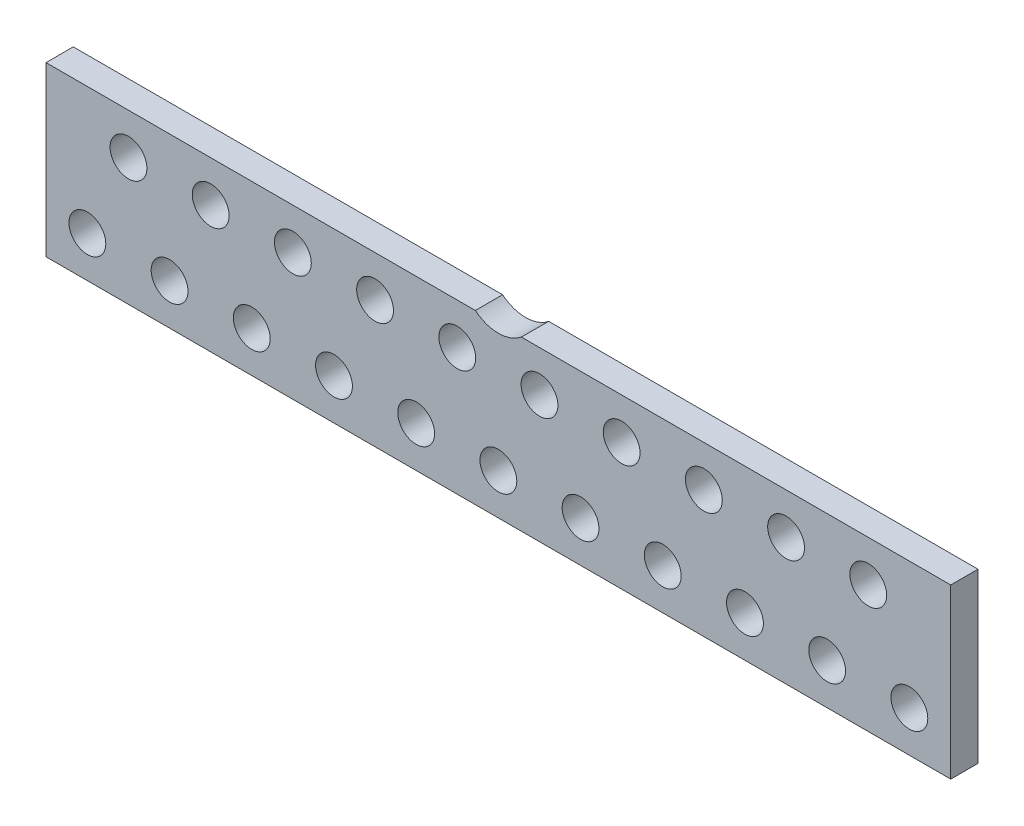
ISO-10303-21;
HEADER;
FILE_DESCRIPTION(('STEP AP214'),'2;1');
FILE_NAME('part.step','',(''),(''),'','','');
FILE_SCHEMA(('AUTOMOTIVE_DESIGN { 1 0 10303 214 1 1 1 1 }'));
ENDSEC;
DATA;
#1=APPLICATION_CONTEXT('core data for automotive mechanical design processes');
#2=APPLICATION_PROTOCOL_DEFINITION('international standard','automotive_design',2000,#1);
#3=PRODUCT_CONTEXT('',#1,'mechanical');
#4=PRODUCT('Part','Part','',(#3));
#5=PRODUCT_RELATED_PRODUCT_CATEGORY('part','',(#4));
#6=PRODUCT_DEFINITION_FORMATION('','',#4);
#7=PRODUCT_DEFINITION_CONTEXT('part definition',#1,'design');
#8=PRODUCT_DEFINITION('design','',#6,#7);
#9=PRODUCT_DEFINITION_SHAPE('','',#8);
#10=(LENGTH_UNIT() NAMED_UNIT(*) SI_UNIT(.MILLI.,.METRE.));
#11=(NAMED_UNIT(*) PLANE_ANGLE_UNIT() SI_UNIT($,.RADIAN.));
#12=(NAMED_UNIT(*) SI_UNIT($,.STERADIAN.) SOLID_ANGLE_UNIT());
#13=UNCERTAINTY_MEASURE_WITH_UNIT(LENGTH_MEASURE(1.E-05),#10,'distance_accuracy_value','');
#14=(GEOMETRIC_REPRESENTATION_CONTEXT(3) GLOBAL_UNCERTAINTY_ASSIGNED_CONTEXT((#13)) GLOBAL_UNIT_ASSIGNED_CONTEXT((#10,
#11,#12)) REPRESENTATION_CONTEXT('',''));
#15=CARTESIAN_POINT('',(0.,0.,0.));
#16=DIRECTION('',(0.,0.,1.));
#17=DIRECTION('',(1.,0.,0.));
#18=AXIS2_PLACEMENT_3D('',#15,#16,#17);
#19=CARTESIAN_POINT('',(0.,4.915,1.066));
#20=DIRECTION('',(0.,0.,1.));
#21=DIRECTION('',(1.,0.,0.));
#22=AXIS2_PLACEMENT_3D('',#19,#20,#21);
#23=CYLINDRICAL_SURFACE('',#22,1.59207048288274);
#24=CARTESIAN_POINT('',(0.,4.915,2.26));
#25=DIRECTION('',(0.,0.,1.));
#26=DIRECTION('',(1.,0.,0.));
#27=AXIS2_PLACEMENT_3D('',#24,#25,#26);
#28=CIRCLE('',#27,1.59207048288274);
#29=CARTESIAN_POINT('',(-1.00839695679156,3.683,2.26));
#30=VERTEX_POINT('',#29);
#31=CARTESIAN_POINT('',(1.00839695679156,3.683,2.26));
#32=VERTEX_POINT('',#31);
#33=EDGE_CURVE('E117',#30,#32,#28,.T.);
#34=ORIENTED_EDGE('',*,*,#33,.T.);
#35=DIRECTION('',(0.,0.,1.));
#36=VECTOR('',#35,1.);
#37=CARTESIAN_POINT('',(1.00839695679156,3.683,1.066));
#38=LINE('',#37,#36);
#39=CARTESIAN_POINT('',(1.00839695679156,3.683,1.066));
#40=VERTEX_POINT('',#39);
#41=EDGE_CURVE('E11',#40,#32,#38,.T.);
#42=ORIENTED_EDGE('',*,*,#41,.F.);
#43=CARTESIAN_POINT('',(0.,4.915,1.066));
#44=DIRECTION('',(0.,0.,1.));
#45=DIRECTION('',(1.,0.,0.));
#46=AXIS2_PLACEMENT_3D('',#43,#44,#45);
#47=CIRCLE('',#46,1.59207048288274);
#48=CARTESIAN_POINT('',(-1.00839695679156,3.683,1.066));
#49=VERTEX_POINT('',#48);
#50=EDGE_CURVE('E131',#49,#40,#47,.T.);
#51=ORIENTED_EDGE('',*,*,#50,.F.);
#52=DIRECTION('',(0.,0.,1.));
#53=VECTOR('',#52,1.);
#54=CARTESIAN_POINT('',(-1.00839695679156,3.683,1.066));
#55=LINE('',#54,#53);
#56=EDGE_CURVE('E49',#49,#30,#55,.T.);
#57=ORIENTED_EDGE('',*,*,#56,.T.);
#58=EDGE_LOOP('',(#34,#42,#51,#57));
#59=FACE_BOUND('',#58,.T.);
#60=ADVANCED_FACE('F33',(#59),#23,.F.);
#61=CARTESIAN_POINT('',(1.00839695679156,3.683,1.066));
#62=DIRECTION('',(0.,-1.,0.));
#63=DIRECTION('',(0.,0.,-1.));
#64=AXIS2_PLACEMENT_3D('',#61,#62,#63);
#65=PLANE('',#64);
#66=DIRECTION('',(1.,0.,0.));
#67=VECTOR('',#66,1.);
#68=CARTESIAN_POINT('',(1.00839695679156,3.683,2.26));
#69=LINE('',#68,#67);
#70=CARTESIAN_POINT('',(19.812,3.683,2.26));
#71=VERTEX_POINT('',#70);
#72=EDGE_CURVE('E119',#32,#71,#69,.T.);
#73=ORIENTED_EDGE('',*,*,#72,.T.);
#74=DIRECTION('',(0.,0.,1.));
#75=VECTOR('',#74,1.);
#76=CARTESIAN_POINT('',(19.812,3.683,1.066));
#77=LINE('',#76,#75);
#78=CARTESIAN_POINT('',(19.812,3.683,1.066));
#79=VERTEX_POINT('',#78);
#80=EDGE_CURVE('E41',#79,#71,#77,.T.);
#81=ORIENTED_EDGE('',*,*,#80,.F.);
#82=DIRECTION('',(1.,0.,0.));
#83=VECTOR('',#82,1.);
#84=CARTESIAN_POINT('',(1.00839695679156,3.683,1.066));
#85=LINE('',#84,#83);
#86=EDGE_CURVE('E81',#40,#79,#85,.T.);
#87=ORIENTED_EDGE('',*,*,#86,.F.);
#88=ORIENTED_EDGE('',*,*,#41,.T.);
#89=EDGE_LOOP('',(#73,#81,#87,#88));
#90=FACE_BOUND('',#89,.T.);
#91=ADVANCED_FACE('F152',(#90),#65,.F.);
#92=CARTESIAN_POINT('',(19.812,3.683,1.066));
#93=DIRECTION('',(-1.,0.,0.));
#94=DIRECTION('',(0.,0.,1.));
#95=AXIS2_PLACEMENT_3D('',#92,#93,#94);
#96=PLANE('',#95);
#97=DIRECTION('',(0.,-1.,0.));
#98=VECTOR('',#97,1.);
#99=CARTESIAN_POINT('',(19.812,3.683,2.26));
#100=LINE('',#99,#98);
#101=CARTESIAN_POINT('',(19.812,-3.683,2.26));
#102=VERTEX_POINT('',#101);
#103=EDGE_CURVE('E122',#71,#102,#100,.T.);
#104=ORIENTED_EDGE('',*,*,#103,.T.);
#105=DIRECTION('',(0.,0.,1.));
#106=VECTOR('',#105,1.);
#107=CARTESIAN_POINT('',(19.812,-3.683,1.066));
#108=LINE('',#107,#106);
#109=CARTESIAN_POINT('',(19.812,-3.683,1.066));
#110=VERTEX_POINT('',#109);
#111=EDGE_CURVE('E100',#110,#102,#108,.T.);
#112=ORIENTED_EDGE('',*,*,#111,.F.);
#113=DIRECTION('',(0.,-1.,0.));
#114=VECTOR('',#113,1.);
#115=CARTESIAN_POINT('',(19.812,3.683,1.066));
#116=LINE('',#115,#114);
#117=EDGE_CURVE('E108',#79,#110,#116,.T.);
#118=ORIENTED_EDGE('',*,*,#117,.F.);
#119=ORIENTED_EDGE('',*,*,#80,.T.);
#120=EDGE_LOOP('',(#104,#112,#118,#119));
#121=FACE_BOUND('',#120,.T.);
#122=ADVANCED_FACE('F137',(#121),#96,.F.);
#123=CARTESIAN_POINT('',(-19.8120000000001,-3.683,1.066));
#124=DIRECTION('',(0.,-1.,0.));
#125=DIRECTION('',(0.,0.,-1.));
#126=AXIS2_PLACEMENT_3D('',#123,#124,#125);
#127=PLANE('',#126);
#128=DIRECTION('',(1.,0.,0.));
#129=VECTOR('',#128,1.);
#130=CARTESIAN_POINT('',(-19.8120000000001,-3.683,2.26));
#131=LINE('',#130,#129);
#132=CARTESIAN_POINT('',(-19.8120000000001,-3.683,2.26));
#133=VERTEX_POINT('',#132);
#134=EDGE_CURVE('E96',#133,#102,#131,.T.);
#135=ORIENTED_EDGE('',*,*,#134,.F.);
#136=DIRECTION('',(0.,0.,1.));
#137=VECTOR('',#136,1.);
#138=CARTESIAN_POINT('',(-19.8120000000001,-3.683,1.066));
#139=LINE('',#138,#137);
#140=CARTESIAN_POINT('',(-19.8120000000001,-3.683,1.066));
#141=VERTEX_POINT('',#140);
#142=EDGE_CURVE('E91',#141,#133,#139,.T.);
#143=ORIENTED_EDGE('',*,*,#142,.F.);
#144=DIRECTION('',(1.,0.,0.));
#145=VECTOR('',#144,1.);
#146=CARTESIAN_POINT('',(-19.8120000000001,-3.683,1.066));
#147=LINE('',#146,#145);
#148=EDGE_CURVE('E94',#141,#110,#147,.T.);
#149=ORIENTED_EDGE('',*,*,#148,.T.);
#150=ORIENTED_EDGE('',*,*,#111,.T.);
#151=EDGE_LOOP('',(#135,#143,#149,#150));
#152=FACE_BOUND('',#151,.T.);
#153=ADVANCED_FACE('F93',(#152),#127,.T.);
#154=CARTESIAN_POINT('',(-19.8120000000001,3.683,1.066));
#155=DIRECTION('',(-1.,0.,0.));
#156=DIRECTION('',(0.,0.,1.));
#157=AXIS2_PLACEMENT_3D('',#154,#155,#156);
#158=PLANE('',#157);
#159=DIRECTION('',(0.,-1.,0.));
#160=VECTOR('',#159,1.);
#161=CARTESIAN_POINT('',(-19.8120000000001,3.683,2.26));
#162=LINE('',#161,#160);
#163=CARTESIAN_POINT('',(-19.8120000000001,3.683,2.26));
#164=VERTEX_POINT('',#163);
#165=EDGE_CURVE('E126',#164,#133,#162,.T.);
#166=ORIENTED_EDGE('',*,*,#165,.F.);
#167=DIRECTION('',(0.,0.,1.));
#168=VECTOR('',#167,1.);
#169=CARTESIAN_POINT('',(-19.8120000000001,3.683,1.066));
#170=LINE('',#169,#168);
#171=CARTESIAN_POINT('',(-19.8120000000001,3.683,1.066));
#172=VERTEX_POINT('',#171);
#173=EDGE_CURVE('E69',#172,#164,#170,.T.);
#174=ORIENTED_EDGE('',*,*,#173,.F.);
#175=DIRECTION('',(0.,-1.,0.));
#176=VECTOR('',#175,1.);
#177=CARTESIAN_POINT('',(-19.8120000000001,3.683,1.066));
#178=LINE('',#177,#176);
#179=EDGE_CURVE('E106',#172,#141,#178,.T.);
#180=ORIENTED_EDGE('',*,*,#179,.T.);
#181=ORIENTED_EDGE('',*,*,#142,.T.);
#182=EDGE_LOOP('',(#166,#174,#180,#181));
#183=FACE_BOUND('',#182,.T.);
#184=ADVANCED_FACE('F111',(#183),#158,.T.);
#185=CARTESIAN_POINT('',(-1.00839695679156,3.683,1.066));
#186=DIRECTION('',(0.,1.,0.));
#187=DIRECTION('',(0.,0.,1.));
#188=AXIS2_PLACEMENT_3D('',#185,#186,#187);
#189=PLANE('',#188);
#190=DIRECTION('',(-1.,0.,0.));
#191=VECTOR('',#190,1.);
#192=CARTESIAN_POINT('',(-1.00839695679156,3.683,2.26));
#193=LINE('',#192,#191);
#194=EDGE_CURVE('E128',#30,#164,#193,.T.);
#195=ORIENTED_EDGE('',*,*,#194,.F.);
#196=ORIENTED_EDGE('',*,*,#56,.F.);
#197=DIRECTION('',(-1.,0.,0.));
#198=VECTOR('',#197,1.);
#199=CARTESIAN_POINT('',(-1.00839695679156,3.683,1.066));
#200=LINE('',#199,#198);
#201=EDGE_CURVE('E112',#49,#172,#200,.T.);
#202=ORIENTED_EDGE('',*,*,#201,.T.);
#203=ORIENTED_EDGE('',*,*,#173,.T.);
#204=EDGE_LOOP('',(#195,#196,#202,#203));
#205=FACE_BOUND('',#204,.T.);
#206=ADVANCED_FACE('F140',(#205),#189,.T.);
#207=CARTESIAN_POINT('',(0.,4.915,1.066));
#208=DIRECTION('',(0.,0.,1.));
#209=DIRECTION('',(1.,0.,0.));
#210=AXIS2_PLACEMENT_3D('',#207,#208,#209);
#211=PLANE('',#210);
#212=CARTESIAN_POINT('',(16.2,1.885,1.066));
#213=DIRECTION('',(0.,0.,1.));
#214=DIRECTION('',(1.,0.,0.));
#215=AXIS2_PLACEMENT_3D('',#212,#213,#214);
#216=CIRCLE('',#215,0.8065);
#217=CARTESIAN_POINT('',(17.0065,1.885,1.066));
#218=VERTEX_POINT('',#217);
#219=EDGE_CURVE('E277',#218,#218,#216,.T.);
#220=ORIENTED_EDGE('',*,*,#219,.T.);
#221=EDGE_LOOP('',(#220));
#222=FACE_BOUND('',#221,.T.);
#223=CARTESIAN_POINT('',(12.6,1.885,1.066));
#224=DIRECTION('',(0.,0.,1.));
#225=DIRECTION('',(1.,0.,0.));
#226=AXIS2_PLACEMENT_3D('',#223,#224,#225);
#227=CIRCLE('',#226,0.8065);
#228=CARTESIAN_POINT('',(13.4065,1.885,1.066));
#229=VERTEX_POINT('',#228);
#230=EDGE_CURVE('E271',#229,#229,#227,.T.);
#231=ORIENTED_EDGE('',*,*,#230,.T.);
#232=EDGE_LOOP('',(#231));
#233=FACE_BOUND('',#232,.T.);
#234=CARTESIAN_POINT('',(8.99999999999999,1.885,1.066));
#235=DIRECTION('',(0.,0.,1.));
#236=DIRECTION('',(1.,0.,0.));
#237=AXIS2_PLACEMENT_3D('',#234,#235,#236);
#238=CIRCLE('',#237,0.8065);
#239=CARTESIAN_POINT('',(9.80649999999999,1.885,1.066));
#240=VERTEX_POINT('',#239);
#241=EDGE_CURVE('E265',#240,#240,#238,.T.);
#242=ORIENTED_EDGE('',*,*,#241,.T.);
#243=EDGE_LOOP('',(#242));
#244=FACE_BOUND('',#243,.T.);
#245=CARTESIAN_POINT('',(5.4,1.885,1.066));
#246=DIRECTION('',(0.,0.,1.));
#247=DIRECTION('',(1.,0.,0.));
#248=AXIS2_PLACEMENT_3D('',#245,#246,#247);
#249=CIRCLE('',#248,0.8065);
#250=CARTESIAN_POINT('',(6.20649999999999,1.885,1.066));
#251=VERTEX_POINT('',#250);
#252=EDGE_CURVE('E259',#251,#251,#249,.T.);
#253=ORIENTED_EDGE('',*,*,#252,.T.);
#254=EDGE_LOOP('',(#253));
#255=FACE_BOUND('',#254,.T.);
#256=CARTESIAN_POINT('',(1.8,1.885,1.066));
#257=DIRECTION('',(0.,0.,1.));
#258=DIRECTION('',(1.,0.,0.));
#259=AXIS2_PLACEMENT_3D('',#256,#257,#258);
#260=CIRCLE('',#259,0.8065);
#261=CARTESIAN_POINT('',(2.6065,1.885,1.066));
#262=VERTEX_POINT('',#261);
#263=EDGE_CURVE('E253',#262,#262,#260,.T.);
#264=ORIENTED_EDGE('',*,*,#263,.T.);
#265=EDGE_LOOP('',(#264));
#266=FACE_BOUND('',#265,.T.);
#267=CARTESIAN_POINT('',(-1.8,1.885,1.066));
#268=DIRECTION('',(0.,0.,1.));
#269=DIRECTION('',(1.,0.,0.));
#270=AXIS2_PLACEMENT_3D('',#267,#268,#269);
#271=CIRCLE('',#270,0.8065);
#272=CARTESIAN_POINT('',(-0.993500000000003,1.885,1.066));
#273=VERTEX_POINT('',#272);
#274=EDGE_CURVE('E247',#273,#273,#271,.T.);
#275=ORIENTED_EDGE('',*,*,#274,.T.);
#276=EDGE_LOOP('',(#275));
#277=FACE_BOUND('',#276,.T.);
#278=CARTESIAN_POINT('',(-5.4,1.885,1.066));
#279=DIRECTION('',(0.,0.,1.));
#280=DIRECTION('',(1.,0.,0.));
#281=AXIS2_PLACEMENT_3D('',#278,#279,#280);
#282=CIRCLE('',#281,0.8065);
#283=CARTESIAN_POINT('',(-4.5935,1.885,1.066));
#284=VERTEX_POINT('',#283);
#285=EDGE_CURVE('E241',#284,#284,#282,.T.);
#286=ORIENTED_EDGE('',*,*,#285,.T.);
#287=EDGE_LOOP('',(#286));
#288=FACE_BOUND('',#287,.T.);
#289=CARTESIAN_POINT('',(-9.,1.885,1.066));
#290=DIRECTION('',(0.,0.,1.));
#291=DIRECTION('',(1.,0.,0.));
#292=AXIS2_PLACEMENT_3D('',#289,#290,#291);
#293=CIRCLE('',#292,0.8065);
#294=CARTESIAN_POINT('',(-8.1935,1.885,1.066));
#295=VERTEX_POINT('',#294);
#296=EDGE_CURVE('E235',#295,#295,#293,.T.);
#297=ORIENTED_EDGE('',*,*,#296,.T.);
#298=EDGE_LOOP('',(#297));
#299=FACE_BOUND('',#298,.T.);
#300=CARTESIAN_POINT('',(-12.6,1.885,1.066));
#301=DIRECTION('',(0.,0.,1.));
#302=DIRECTION('',(1.,0.,0.));
#303=AXIS2_PLACEMENT_3D('',#300,#301,#302);
#304=CIRCLE('',#303,0.8065);
#305=CARTESIAN_POINT('',(-11.7935,1.885,1.066));
#306=VERTEX_POINT('',#305);
#307=EDGE_CURVE('E229',#306,#306,#304,.T.);
#308=ORIENTED_EDGE('',*,*,#307,.T.);
#309=EDGE_LOOP('',(#308));
#310=FACE_BOUND('',#309,.T.);
#311=CARTESIAN_POINT('',(18.,-1.885,1.066));
#312=DIRECTION('',(0.,0.,1.));
#313=DIRECTION('',(1.,0.,0.));
#314=AXIS2_PLACEMENT_3D('',#311,#312,#313);
#315=CIRCLE('',#314,0.806500000000003);
#316=CARTESIAN_POINT('',(18.8065,-1.885,1.066));
#317=VERTEX_POINT('',#316);
#318=EDGE_CURVE('E223',#317,#317,#315,.T.);
#319=ORIENTED_EDGE('',*,*,#318,.T.);
#320=EDGE_LOOP('',(#319));
#321=FACE_BOUND('',#320,.T.);
#322=CARTESIAN_POINT('',(14.4,-1.885,1.066));
#323=DIRECTION('',(0.,0.,1.));
#324=DIRECTION('',(1.,0.,0.));
#325=AXIS2_PLACEMENT_3D('',#322,#323,#324);
#326=CIRCLE('',#325,0.806500000000003);
#327=CARTESIAN_POINT('',(15.2065,-1.885,1.066));
#328=VERTEX_POINT('',#327);
#329=EDGE_CURVE('E217',#328,#328,#326,.T.);
#330=ORIENTED_EDGE('',*,*,#329,.T.);
#331=EDGE_LOOP('',(#330));
#332=FACE_BOUND('',#331,.T.);
#333=CARTESIAN_POINT('',(10.8,-1.885,1.066));
#334=DIRECTION('',(0.,0.,1.));
#335=DIRECTION('',(1.,0.,0.));
#336=AXIS2_PLACEMENT_3D('',#333,#334,#335);
#337=CIRCLE('',#336,0.806500000000003);
#338=CARTESIAN_POINT('',(11.6065,-1.885,1.066));
#339=VERTEX_POINT('',#338);
#340=EDGE_CURVE('E211',#339,#339,#337,.T.);
#341=ORIENTED_EDGE('',*,*,#340,.T.);
#342=EDGE_LOOP('',(#341));
#343=FACE_BOUND('',#342,.T.);
#344=CARTESIAN_POINT('',(7.19999999999999,-1.885,1.066));
#345=DIRECTION('',(0.,0.,1.));
#346=DIRECTION('',(1.,0.,0.));
#347=AXIS2_PLACEMENT_3D('',#344,#345,#346);
#348=CIRCLE('',#347,0.806500000000003);
#349=CARTESIAN_POINT('',(8.0065,-1.885,1.066));
#350=VERTEX_POINT('',#349);
#351=EDGE_CURVE('E205',#350,#350,#348,.T.);
#352=ORIENTED_EDGE('',*,*,#351,.T.);
#353=EDGE_LOOP('',(#352));
#354=FACE_BOUND('',#353,.T.);
#355=CARTESIAN_POINT('',(3.6,-1.885,1.066));
#356=DIRECTION('',(0.,0.,1.));
#357=DIRECTION('',(1.,0.,0.));
#358=AXIS2_PLACEMENT_3D('',#355,#356,#357);
#359=CIRCLE('',#358,0.806500000000003);
#360=CARTESIAN_POINT('',(4.4065,-1.885,1.066));
#361=VERTEX_POINT('',#360);
#362=EDGE_CURVE('E199',#361,#361,#359,.T.);
#363=ORIENTED_EDGE('',*,*,#362,.T.);
#364=EDGE_LOOP('',(#363));
#365=FACE_BOUND('',#364,.T.);
#366=CARTESIAN_POINT('',(0.,-1.885,1.066));
#367=DIRECTION('',(0.,0.,1.));
#368=DIRECTION('',(1.,0.,0.));
#369=AXIS2_PLACEMENT_3D('',#366,#367,#368);
#370=CIRCLE('',#369,0.806500000000003);
#371=CARTESIAN_POINT('',(0.8065,-1.885,1.066));
#372=VERTEX_POINT('',#371);
#373=EDGE_CURVE('E193',#372,#372,#370,.T.);
#374=ORIENTED_EDGE('',*,*,#373,.T.);
#375=EDGE_LOOP('',(#374));
#376=FACE_BOUND('',#375,.T.);
#377=CARTESIAN_POINT('',(-3.6,-1.885,1.066));
#378=DIRECTION('',(0.,0.,1.));
#379=DIRECTION('',(1.,0.,0.));
#380=AXIS2_PLACEMENT_3D('',#377,#378,#379);
#381=CIRCLE('',#380,0.806500000000003);
#382=CARTESIAN_POINT('',(-2.7935,-1.885,1.066));
#383=VERTEX_POINT('',#382);
#384=EDGE_CURVE('E187',#383,#383,#381,.T.);
#385=ORIENTED_EDGE('',*,*,#384,.T.);
#386=EDGE_LOOP('',(#385));
#387=FACE_BOUND('',#386,.T.);
#388=CARTESIAN_POINT('',(-7.2,-1.885,1.066));
#389=DIRECTION('',(0.,0.,1.));
#390=DIRECTION('',(1.,0.,0.));
#391=AXIS2_PLACEMENT_3D('',#388,#389,#390);
#392=CIRCLE('',#391,0.806500000000003);
#393=CARTESIAN_POINT('',(-6.3935,-1.885,1.066));
#394=VERTEX_POINT('',#393);
#395=EDGE_CURVE('E181',#394,#394,#392,.T.);
#396=ORIENTED_EDGE('',*,*,#395,.T.);
#397=EDGE_LOOP('',(#396));
#398=FACE_BOUND('',#397,.T.);
#399=CARTESIAN_POINT('',(-10.8,-1.885,1.066));
#400=DIRECTION('',(0.,0.,1.));
#401=DIRECTION('',(1.,0.,0.));
#402=AXIS2_PLACEMENT_3D('',#399,#400,#401);
#403=CIRCLE('',#402,0.806500000000003);
#404=CARTESIAN_POINT('',(-9.9935,-1.885,1.066));
#405=VERTEX_POINT('',#404);
#406=EDGE_CURVE('E175',#405,#405,#403,.T.);
#407=ORIENTED_EDGE('',*,*,#406,.T.);
#408=EDGE_LOOP('',(#407));
#409=FACE_BOUND('',#408,.T.);
#410=CARTESIAN_POINT('',(-14.4,-1.885,1.066));
#411=DIRECTION('',(0.,0.,1.));
#412=DIRECTION('',(1.,0.,0.));
#413=AXIS2_PLACEMENT_3D('',#410,#411,#412);
#414=CIRCLE('',#413,0.806500000000003);
#415=CARTESIAN_POINT('',(-13.5935,-1.885,1.066));
#416=VERTEX_POINT('',#415);
#417=EDGE_CURVE('E169',#416,#416,#414,.T.);
#418=ORIENTED_EDGE('',*,*,#417,.T.);
#419=EDGE_LOOP('',(#418));
#420=FACE_BOUND('',#419,.T.);
#421=CARTESIAN_POINT('',(-16.2,1.885,1.066));
#422=DIRECTION('',(0.,0.,1.));
#423=DIRECTION('',(1.,0.,0.));
#424=AXIS2_PLACEMENT_3D('',#421,#422,#423);
#425=CIRCLE('',#424,0.8065);
#426=CARTESIAN_POINT('',(-15.3935,1.885,1.066));
#427=VERTEX_POINT('',#426);
#428=EDGE_CURVE('E163',#427,#427,#425,.T.);
#429=ORIENTED_EDGE('',*,*,#428,.T.);
#430=EDGE_LOOP('',(#429));
#431=FACE_BOUND('',#430,.T.);
#432=CARTESIAN_POINT('',(-18.,-1.885,1.066));
#433=DIRECTION('',(0.,0.,1.));
#434=DIRECTION('',(1.,0.,0.));
#435=AXIS2_PLACEMENT_3D('',#432,#433,#434);
#436=CIRCLE('',#435,0.806500000000003);
#437=CARTESIAN_POINT('',(-17.1935,-1.885,1.066));
#438=VERTEX_POINT('',#437);
#439=EDGE_CURVE('E120',#438,#438,#436,.T.);
#440=ORIENTED_EDGE('',*,*,#439,.T.);
#441=EDGE_LOOP('',(#440));
#442=FACE_BOUND('',#441,.T.);
#443=ORIENTED_EDGE('',*,*,#50,.T.);
#444=ORIENTED_EDGE('',*,*,#86,.T.);
#445=ORIENTED_EDGE('',*,*,#117,.T.);
#446=ORIENTED_EDGE('',*,*,#148,.F.);
#447=ORIENTED_EDGE('',*,*,#179,.F.);
#448=ORIENTED_EDGE('',*,*,#201,.F.);
#449=EDGE_LOOP('',(#443,#444,#445,#446,#447,#448));
#450=FACE_BOUND('',#449,.T.);
#451=ADVANCED_FACE('F104',(#222,#233,#244,#255,#266,#277,#288,#299,#310,#321,#332,#343,#354,
#365,#376,#387,#398,#409,#420,#431,#442,#450),#211,.F.);
#452=CARTESIAN_POINT('',(0.,4.915,2.26));
#453=DIRECTION('',(0.,0.,1.));
#454=DIRECTION('',(1.,0.,0.));
#455=AXIS2_PLACEMENT_3D('',#452,#453,#454);
#456=PLANE('',#455);
#457=CARTESIAN_POINT('',(16.2,1.885,2.26));
#458=DIRECTION('',(0.,0.,1.));
#459=DIRECTION('',(1.,0.,0.));
#460=AXIS2_PLACEMENT_3D('',#457,#458,#459);
#461=CIRCLE('',#460,0.8065);
#462=CARTESIAN_POINT('',(17.0065,1.885,2.26));
#463=VERTEX_POINT('',#462);
#464=EDGE_CURVE('E280',#463,#463,#461,.T.);
#465=ORIENTED_EDGE('',*,*,#464,.F.);
#466=EDGE_LOOP('',(#465));
#467=FACE_BOUND('',#466,.T.);
#468=CARTESIAN_POINT('',(12.6,1.885,2.26));
#469=DIRECTION('',(0.,0.,1.));
#470=DIRECTION('',(1.,0.,0.));
#471=AXIS2_PLACEMENT_3D('',#468,#469,#470);
#472=CIRCLE('',#471,0.8065);
#473=CARTESIAN_POINT('',(13.4065,1.885,2.26));
#474=VERTEX_POINT('',#473);
#475=EDGE_CURVE('E274',#474,#474,#472,.T.);
#476=ORIENTED_EDGE('',*,*,#475,.F.);
#477=EDGE_LOOP('',(#476));
#478=FACE_BOUND('',#477,.T.);
#479=CARTESIAN_POINT('',(8.99999999999999,1.885,2.26));
#480=DIRECTION('',(0.,0.,1.));
#481=DIRECTION('',(1.,0.,0.));
#482=AXIS2_PLACEMENT_3D('',#479,#480,#481);
#483=CIRCLE('',#482,0.8065);
#484=CARTESIAN_POINT('',(9.80649999999999,1.885,2.26));
#485=VERTEX_POINT('',#484);
#486=EDGE_CURVE('E268',#485,#485,#483,.T.);
#487=ORIENTED_EDGE('',*,*,#486,.F.);
#488=EDGE_LOOP('',(#487));
#489=FACE_BOUND('',#488,.T.);
#490=CARTESIAN_POINT('',(5.4,1.885,2.26));
#491=DIRECTION('',(0.,0.,1.));
#492=DIRECTION('',(1.,0.,0.));
#493=AXIS2_PLACEMENT_3D('',#490,#491,#492);
#494=CIRCLE('',#493,0.8065);
#495=CARTESIAN_POINT('',(6.20649999999999,1.885,2.26));
#496=VERTEX_POINT('',#495);
#497=EDGE_CURVE('E262',#496,#496,#494,.T.);
#498=ORIENTED_EDGE('',*,*,#497,.F.);
#499=EDGE_LOOP('',(#498));
#500=FACE_BOUND('',#499,.T.);
#501=CARTESIAN_POINT('',(1.8,1.885,2.26));
#502=DIRECTION('',(0.,0.,1.));
#503=DIRECTION('',(1.,0.,0.));
#504=AXIS2_PLACEMENT_3D('',#501,#502,#503);
#505=CIRCLE('',#504,0.8065);
#506=CARTESIAN_POINT('',(2.6065,1.885,2.26));
#507=VERTEX_POINT('',#506);
#508=EDGE_CURVE('E256',#507,#507,#505,.T.);
#509=ORIENTED_EDGE('',*,*,#508,.F.);
#510=EDGE_LOOP('',(#509));
#511=FACE_BOUND('',#510,.T.);
#512=CARTESIAN_POINT('',(-1.8,1.885,2.26));
#513=DIRECTION('',(0.,0.,1.));
#514=DIRECTION('',(1.,0.,0.));
#515=AXIS2_PLACEMENT_3D('',#512,#513,#514);
#516=CIRCLE('',#515,0.8065);
#517=CARTESIAN_POINT('',(-0.993500000000003,1.885,2.26));
#518=VERTEX_POINT('',#517);
#519=EDGE_CURVE('E250',#518,#518,#516,.T.);
#520=ORIENTED_EDGE('',*,*,#519,.F.);
#521=EDGE_LOOP('',(#520));
#522=FACE_BOUND('',#521,.T.);
#523=CARTESIAN_POINT('',(-5.4,1.885,2.26));
#524=DIRECTION('',(0.,0.,1.));
#525=DIRECTION('',(1.,0.,0.));
#526=AXIS2_PLACEMENT_3D('',#523,#524,#525);
#527=CIRCLE('',#526,0.8065);
#528=CARTESIAN_POINT('',(-4.5935,1.885,2.26));
#529=VERTEX_POINT('',#528);
#530=EDGE_CURVE('E244',#529,#529,#527,.T.);
#531=ORIENTED_EDGE('',*,*,#530,.F.);
#532=EDGE_LOOP('',(#531));
#533=FACE_BOUND('',#532,.T.);
#534=CARTESIAN_POINT('',(-9.,1.885,2.26));
#535=DIRECTION('',(0.,0.,1.));
#536=DIRECTION('',(1.,0.,0.));
#537=AXIS2_PLACEMENT_3D('',#534,#535,#536);
#538=CIRCLE('',#537,0.8065);
#539=CARTESIAN_POINT('',(-8.1935,1.885,2.26));
#540=VERTEX_POINT('',#539);
#541=EDGE_CURVE('E238',#540,#540,#538,.T.);
#542=ORIENTED_EDGE('',*,*,#541,.F.);
#543=EDGE_LOOP('',(#542));
#544=FACE_BOUND('',#543,.T.);
#545=CARTESIAN_POINT('',(-12.6,1.885,2.26));
#546=DIRECTION('',(0.,0.,1.));
#547=DIRECTION('',(1.,0.,0.));
#548=AXIS2_PLACEMENT_3D('',#545,#546,#547);
#549=CIRCLE('',#548,0.8065);
#550=CARTESIAN_POINT('',(-11.7935,1.885,2.26));
#551=VERTEX_POINT('',#550);
#552=EDGE_CURVE('E232',#551,#551,#549,.T.);
#553=ORIENTED_EDGE('',*,*,#552,.F.);
#554=EDGE_LOOP('',(#553));
#555=FACE_BOUND('',#554,.T.);
#556=CARTESIAN_POINT('',(18.,-1.885,2.26));
#557=DIRECTION('',(0.,0.,1.));
#558=DIRECTION('',(1.,0.,0.));
#559=AXIS2_PLACEMENT_3D('',#556,#557,#558);
#560=CIRCLE('',#559,0.806500000000003);
#561=CARTESIAN_POINT('',(18.8065,-1.885,2.26));
#562=VERTEX_POINT('',#561);
#563=EDGE_CURVE('E226',#562,#562,#560,.T.);
#564=ORIENTED_EDGE('',*,*,#563,.F.);
#565=EDGE_LOOP('',(#564));
#566=FACE_BOUND('',#565,.T.);
#567=CARTESIAN_POINT('',(14.4,-1.885,2.26));
#568=DIRECTION('',(0.,0.,1.));
#569=DIRECTION('',(1.,0.,0.));
#570=AXIS2_PLACEMENT_3D('',#567,#568,#569);
#571=CIRCLE('',#570,0.806500000000003);
#572=CARTESIAN_POINT('',(15.2065,-1.885,2.26));
#573=VERTEX_POINT('',#572);
#574=EDGE_CURVE('E220',#573,#573,#571,.T.);
#575=ORIENTED_EDGE('',*,*,#574,.F.);
#576=EDGE_LOOP('',(#575));
#577=FACE_BOUND('',#576,.T.);
#578=CARTESIAN_POINT('',(10.8,-1.885,2.26));
#579=DIRECTION('',(0.,0.,1.));
#580=DIRECTION('',(1.,0.,0.));
#581=AXIS2_PLACEMENT_3D('',#578,#579,#580);
#582=CIRCLE('',#581,0.806500000000003);
#583=CARTESIAN_POINT('',(11.6065,-1.885,2.26));
#584=VERTEX_POINT('',#583);
#585=EDGE_CURVE('E214',#584,#584,#582,.T.);
#586=ORIENTED_EDGE('',*,*,#585,.F.);
#587=EDGE_LOOP('',(#586));
#588=FACE_BOUND('',#587,.T.);
#589=CARTESIAN_POINT('',(7.19999999999999,-1.885,2.26));
#590=DIRECTION('',(0.,0.,1.));
#591=DIRECTION('',(1.,0.,0.));
#592=AXIS2_PLACEMENT_3D('',#589,#590,#591);
#593=CIRCLE('',#592,0.806500000000003);
#594=CARTESIAN_POINT('',(8.0065,-1.885,2.26));
#595=VERTEX_POINT('',#594);
#596=EDGE_CURVE('E208',#595,#595,#593,.T.);
#597=ORIENTED_EDGE('',*,*,#596,.F.);
#598=EDGE_LOOP('',(#597));
#599=FACE_BOUND('',#598,.T.);
#600=CARTESIAN_POINT('',(3.6,-1.885,2.26));
#601=DIRECTION('',(0.,0.,1.));
#602=DIRECTION('',(1.,0.,0.));
#603=AXIS2_PLACEMENT_3D('',#600,#601,#602);
#604=CIRCLE('',#603,0.806500000000003);
#605=CARTESIAN_POINT('',(4.4065,-1.885,2.26));
#606=VERTEX_POINT('',#605);
#607=EDGE_CURVE('E202',#606,#606,#604,.T.);
#608=ORIENTED_EDGE('',*,*,#607,.F.);
#609=EDGE_LOOP('',(#608));
#610=FACE_BOUND('',#609,.T.);
#611=CARTESIAN_POINT('',(0.,-1.885,2.26));
#612=DIRECTION('',(0.,0.,1.));
#613=DIRECTION('',(1.,0.,0.));
#614=AXIS2_PLACEMENT_3D('',#611,#612,#613);
#615=CIRCLE('',#614,0.806500000000003);
#616=CARTESIAN_POINT('',(0.8065,-1.885,2.26));
#617=VERTEX_POINT('',#616);
#618=EDGE_CURVE('E196',#617,#617,#615,.T.);
#619=ORIENTED_EDGE('',*,*,#618,.F.);
#620=EDGE_LOOP('',(#619));
#621=FACE_BOUND('',#620,.T.);
#622=CARTESIAN_POINT('',(-3.6,-1.885,2.26));
#623=DIRECTION('',(0.,0.,1.));
#624=DIRECTION('',(1.,0.,0.));
#625=AXIS2_PLACEMENT_3D('',#622,#623,#624);
#626=CIRCLE('',#625,0.806500000000003);
#627=CARTESIAN_POINT('',(-2.7935,-1.885,2.26));
#628=VERTEX_POINT('',#627);
#629=EDGE_CURVE('E190',#628,#628,#626,.T.);
#630=ORIENTED_EDGE('',*,*,#629,.F.);
#631=EDGE_LOOP('',(#630));
#632=FACE_BOUND('',#631,.T.);
#633=CARTESIAN_POINT('',(-7.2,-1.885,2.26));
#634=DIRECTION('',(0.,0.,1.));
#635=DIRECTION('',(1.,0.,0.));
#636=AXIS2_PLACEMENT_3D('',#633,#634,#635);
#637=CIRCLE('',#636,0.806500000000003);
#638=CARTESIAN_POINT('',(-6.3935,-1.885,2.26));
#639=VERTEX_POINT('',#638);
#640=EDGE_CURVE('E184',#639,#639,#637,.T.);
#641=ORIENTED_EDGE('',*,*,#640,.F.);
#642=EDGE_LOOP('',(#641));
#643=FACE_BOUND('',#642,.T.);
#644=CARTESIAN_POINT('',(-10.8,-1.885,2.26));
#645=DIRECTION('',(0.,0.,1.));
#646=DIRECTION('',(1.,0.,0.));
#647=AXIS2_PLACEMENT_3D('',#644,#645,#646);
#648=CIRCLE('',#647,0.806500000000003);
#649=CARTESIAN_POINT('',(-9.9935,-1.885,2.26));
#650=VERTEX_POINT('',#649);
#651=EDGE_CURVE('E178',#650,#650,#648,.T.);
#652=ORIENTED_EDGE('',*,*,#651,.F.);
#653=EDGE_LOOP('',(#652));
#654=FACE_BOUND('',#653,.T.);
#655=CARTESIAN_POINT('',(-14.4,-1.885,2.26));
#656=DIRECTION('',(0.,0.,1.));
#657=DIRECTION('',(1.,0.,0.));
#658=AXIS2_PLACEMENT_3D('',#655,#656,#657);
#659=CIRCLE('',#658,0.806500000000003);
#660=CARTESIAN_POINT('',(-13.5935,-1.885,2.26));
#661=VERTEX_POINT('',#660);
#662=EDGE_CURVE('E172',#661,#661,#659,.T.);
#663=ORIENTED_EDGE('',*,*,#662,.F.);
#664=EDGE_LOOP('',(#663));
#665=FACE_BOUND('',#664,.T.);
#666=CARTESIAN_POINT('',(-16.2,1.885,2.26));
#667=DIRECTION('',(0.,0.,1.));
#668=DIRECTION('',(1.,0.,0.));
#669=AXIS2_PLACEMENT_3D('',#666,#667,#668);
#670=CIRCLE('',#669,0.8065);
#671=CARTESIAN_POINT('',(-15.3935,1.885,2.26));
#672=VERTEX_POINT('',#671);
#673=EDGE_CURVE('E166',#672,#672,#670,.T.);
#674=ORIENTED_EDGE('',*,*,#673,.F.);
#675=EDGE_LOOP('',(#674));
#676=FACE_BOUND('',#675,.T.);
#677=CARTESIAN_POINT('',(-18.,-1.885,2.26));
#678=DIRECTION('',(0.,0.,1.));
#679=DIRECTION('',(1.,0.,0.));
#680=AXIS2_PLACEMENT_3D('',#677,#678,#679);
#681=CIRCLE('',#680,0.806500000000003);
#682=CARTESIAN_POINT('',(-17.1935,-1.885,2.26));
#683=VERTEX_POINT('',#682);
#684=EDGE_CURVE('E160',#683,#683,#681,.T.);
#685=ORIENTED_EDGE('',*,*,#684,.F.);
#686=EDGE_LOOP('',(#685));
#687=FACE_BOUND('',#686,.T.);
#688=ORIENTED_EDGE('',*,*,#33,.F.);
#689=ORIENTED_EDGE('',*,*,#194,.T.);
#690=ORIENTED_EDGE('',*,*,#165,.T.);
#691=ORIENTED_EDGE('',*,*,#134,.T.);
#692=ORIENTED_EDGE('',*,*,#103,.F.);
#693=ORIENTED_EDGE('',*,*,#72,.F.);
#694=EDGE_LOOP('',(#688,#689,#690,#691,#692,#693));
#695=FACE_BOUND('',#694,.T.);
#696=ADVANCED_FACE('F139',(#467,#478,#489,#500,#511,#522,#533,#544,#555,#566,#577,#588,#599,
#610,#621,#632,#643,#654,#665,#676,#687,#695),#456,.T.);
#697=CARTESIAN_POINT('',(-18.,-1.885,1.066));
#698=DIRECTION('',(0.,0.,1.));
#699=DIRECTION('',(1.,0.,0.));
#700=AXIS2_PLACEMENT_3D('',#697,#698,#699);
#701=CYLINDRICAL_SURFACE('',#700,0.806500000000003);
#702=ORIENTED_EDGE('',*,*,#439,.F.);
#703=EDGE_LOOP('',(#702));
#704=FACE_BOUND('',#703,.T.);
#705=ORIENTED_EDGE('',*,*,#684,.T.);
#706=EDGE_LOOP('',(#705));
#707=FACE_BOUND('',#706,.T.);
#708=ADVANCED_FACE('F296',(#704,#707),#701,.F.);
#709=CARTESIAN_POINT('',(-16.2,1.885,1.066));
#710=DIRECTION('',(0.,0.,1.));
#711=DIRECTION('',(1.,0.,0.));
#712=AXIS2_PLACEMENT_3D('',#709,#710,#711);
#713=CYLINDRICAL_SURFACE('',#712,0.8065);
#714=ORIENTED_EDGE('',*,*,#428,.F.);
#715=EDGE_LOOP('',(#714));
#716=FACE_BOUND('',#715,.T.);
#717=ORIENTED_EDGE('',*,*,#673,.T.);
#718=EDGE_LOOP('',(#717));
#719=FACE_BOUND('',#718,.T.);
#720=ADVANCED_FACE('F338',(#716,#719),#713,.F.);
#721=CARTESIAN_POINT('',(-14.4,-1.885,1.066));
#722=DIRECTION('',(0.,0.,1.));
#723=DIRECTION('',(1.,0.,0.));
#724=AXIS2_PLACEMENT_3D('',#721,#722,#723);
#725=CYLINDRICAL_SURFACE('',#724,0.806500000000003);
#726=ORIENTED_EDGE('',*,*,#417,.F.);
#727=EDGE_LOOP('',(#726));
#728=FACE_BOUND('',#727,.T.);
#729=ORIENTED_EDGE('',*,*,#662,.T.);
#730=EDGE_LOOP('',(#729));
#731=FACE_BOUND('',#730,.T.);
#732=ADVANCED_FACE('F344',(#728,#731),#725,.F.);
#733=CARTESIAN_POINT('',(-10.8,-1.885,1.066));
#734=DIRECTION('',(0.,0.,1.));
#735=DIRECTION('',(1.,0.,0.));
#736=AXIS2_PLACEMENT_3D('',#733,#734,#735);
#737=CYLINDRICAL_SURFACE('',#736,0.806500000000003);
#738=ORIENTED_EDGE('',*,*,#406,.F.);
#739=EDGE_LOOP('',(#738));
#740=FACE_BOUND('',#739,.T.);
#741=ORIENTED_EDGE('',*,*,#651,.T.);
#742=EDGE_LOOP('',(#741));
#743=FACE_BOUND('',#742,.T.);
#744=ADVANCED_FACE('F351',(#740,#743),#737,.F.);
#745=CARTESIAN_POINT('',(-7.2,-1.885,1.066));
#746=DIRECTION('',(0.,0.,1.));
#747=DIRECTION('',(1.,0.,0.));
#748=AXIS2_PLACEMENT_3D('',#745,#746,#747);
#749=CYLINDRICAL_SURFACE('',#748,0.806500000000003);
#750=ORIENTED_EDGE('',*,*,#395,.F.);
#751=EDGE_LOOP('',(#750));
#752=FACE_BOUND('',#751,.T.);
#753=ORIENTED_EDGE('',*,*,#640,.T.);
#754=EDGE_LOOP('',(#753));
#755=FACE_BOUND('',#754,.T.);
#756=ADVANCED_FACE('F355',(#752,#755),#749,.F.);
#757=CARTESIAN_POINT('',(-3.6,-1.885,1.066));
#758=DIRECTION('',(0.,0.,1.));
#759=DIRECTION('',(1.,0.,0.));
#760=AXIS2_PLACEMENT_3D('',#757,#758,#759);
#761=CYLINDRICAL_SURFACE('',#760,0.806500000000003);
#762=ORIENTED_EDGE('',*,*,#384,.F.);
#763=EDGE_LOOP('',(#762));
#764=FACE_BOUND('',#763,.T.);
#765=ORIENTED_EDGE('',*,*,#629,.T.);
#766=EDGE_LOOP('',(#765));
#767=FACE_BOUND('',#766,.T.);
#768=ADVANCED_FACE('F359',(#764,#767),#761,.F.);
#769=CARTESIAN_POINT('',(0.,-1.885,1.066));
#770=DIRECTION('',(0.,0.,1.));
#771=DIRECTION('',(1.,0.,0.));
#772=AXIS2_PLACEMENT_3D('',#769,#770,#771);
#773=CYLINDRICAL_SURFACE('',#772,0.806500000000003);
#774=ORIENTED_EDGE('',*,*,#373,.F.);
#775=EDGE_LOOP('',(#774));
#776=FACE_BOUND('',#775,.T.);
#777=ORIENTED_EDGE('',*,*,#618,.T.);
#778=EDGE_LOOP('',(#777));
#779=FACE_BOUND('',#778,.T.);
#780=ADVANCED_FACE('F363',(#776,#779),#773,.F.);
#781=CARTESIAN_POINT('',(3.6,-1.885,1.066));
#782=DIRECTION('',(0.,0.,1.));
#783=DIRECTION('',(1.,0.,0.));
#784=AXIS2_PLACEMENT_3D('',#781,#782,#783);
#785=CYLINDRICAL_SURFACE('',#784,0.806500000000003);
#786=ORIENTED_EDGE('',*,*,#362,.F.);
#787=EDGE_LOOP('',(#786));
#788=FACE_BOUND('',#787,.T.);
#789=ORIENTED_EDGE('',*,*,#607,.T.);
#790=EDGE_LOOP('',(#789));
#791=FACE_BOUND('',#790,.T.);
#792=ADVANCED_FACE('F367',(#788,#791),#785,.F.);
#793=CARTESIAN_POINT('',(7.19999999999999,-1.885,1.066));
#794=DIRECTION('',(0.,0.,1.));
#795=DIRECTION('',(1.,0.,0.));
#796=AXIS2_PLACEMENT_3D('',#793,#794,#795);
#797=CYLINDRICAL_SURFACE('',#796,0.806500000000003);
#798=ORIENTED_EDGE('',*,*,#351,.F.);
#799=EDGE_LOOP('',(#798));
#800=FACE_BOUND('',#799,.T.);
#801=ORIENTED_EDGE('',*,*,#596,.T.);
#802=EDGE_LOOP('',(#801));
#803=FACE_BOUND('',#802,.T.);
#804=ADVANCED_FACE('F371',(#800,#803),#797,.F.);
#805=CARTESIAN_POINT('',(10.8,-1.885,1.066));
#806=DIRECTION('',(0.,0.,1.));
#807=DIRECTION('',(1.,0.,0.));
#808=AXIS2_PLACEMENT_3D('',#805,#806,#807);
#809=CYLINDRICAL_SURFACE('',#808,0.806500000000003);
#810=ORIENTED_EDGE('',*,*,#340,.F.);
#811=EDGE_LOOP('',(#810));
#812=FACE_BOUND('',#811,.T.);
#813=ORIENTED_EDGE('',*,*,#585,.T.);
#814=EDGE_LOOP('',(#813));
#815=FACE_BOUND('',#814,.T.);
#816=ADVANCED_FACE('F375',(#812,#815),#809,.F.);
#817=CARTESIAN_POINT('',(14.4,-1.885,1.066));
#818=DIRECTION('',(0.,0.,1.));
#819=DIRECTION('',(1.,0.,0.));
#820=AXIS2_PLACEMENT_3D('',#817,#818,#819);
#821=CYLINDRICAL_SURFACE('',#820,0.806500000000003);
#822=ORIENTED_EDGE('',*,*,#329,.F.);
#823=EDGE_LOOP('',(#822));
#824=FACE_BOUND('',#823,.T.);
#825=ORIENTED_EDGE('',*,*,#574,.T.);
#826=EDGE_LOOP('',(#825));
#827=FACE_BOUND('',#826,.T.);
#828=ADVANCED_FACE('F379',(#824,#827),#821,.F.);
#829=CARTESIAN_POINT('',(18.,-1.885,1.066));
#830=DIRECTION('',(0.,0.,1.));
#831=DIRECTION('',(1.,0.,0.));
#832=AXIS2_PLACEMENT_3D('',#829,#830,#831);
#833=CYLINDRICAL_SURFACE('',#832,0.806500000000003);
#834=ORIENTED_EDGE('',*,*,#318,.F.);
#835=EDGE_LOOP('',(#834));
#836=FACE_BOUND('',#835,.T.);
#837=ORIENTED_EDGE('',*,*,#563,.T.);
#838=EDGE_LOOP('',(#837));
#839=FACE_BOUND('',#838,.T.);
#840=ADVANCED_FACE('F383',(#836,#839),#833,.F.);
#841=CARTESIAN_POINT('',(-12.6,1.885,1.066));
#842=DIRECTION('',(0.,0.,1.));
#843=DIRECTION('',(1.,0.,0.));
#844=AXIS2_PLACEMENT_3D('',#841,#842,#843);
#845=CYLINDRICAL_SURFACE('',#844,0.8065);
#846=ORIENTED_EDGE('',*,*,#307,.F.);
#847=EDGE_LOOP('',(#846));
#848=FACE_BOUND('',#847,.T.);
#849=ORIENTED_EDGE('',*,*,#552,.T.);
#850=EDGE_LOOP('',(#849));
#851=FACE_BOUND('',#850,.T.);
#852=ADVANCED_FACE('F387',(#848,#851),#845,.F.);
#853=CARTESIAN_POINT('',(-9.,1.885,1.066));
#854=DIRECTION('',(0.,0.,1.));
#855=DIRECTION('',(1.,0.,0.));
#856=AXIS2_PLACEMENT_3D('',#853,#854,#855);
#857=CYLINDRICAL_SURFACE('',#856,0.8065);
#858=ORIENTED_EDGE('',*,*,#296,.F.);
#859=EDGE_LOOP('',(#858));
#860=FACE_BOUND('',#859,.T.);
#861=ORIENTED_EDGE('',*,*,#541,.T.);
#862=EDGE_LOOP('',(#861));
#863=FACE_BOUND('',#862,.T.);
#864=ADVANCED_FACE('F391',(#860,#863),#857,.F.);
#865=CARTESIAN_POINT('',(-5.4,1.885,1.066));
#866=DIRECTION('',(0.,0.,1.));
#867=DIRECTION('',(1.,0.,0.));
#868=AXIS2_PLACEMENT_3D('',#865,#866,#867);
#869=CYLINDRICAL_SURFACE('',#868,0.8065);
#870=ORIENTED_EDGE('',*,*,#285,.F.);
#871=EDGE_LOOP('',(#870));
#872=FACE_BOUND('',#871,.T.);
#873=ORIENTED_EDGE('',*,*,#530,.T.);
#874=EDGE_LOOP('',(#873));
#875=FACE_BOUND('',#874,.T.);
#876=ADVANCED_FACE('F395',(#872,#875),#869,.F.);
#877=CARTESIAN_POINT('',(-1.8,1.885,1.066));
#878=DIRECTION('',(0.,0.,1.));
#879=DIRECTION('',(1.,0.,0.));
#880=AXIS2_PLACEMENT_3D('',#877,#878,#879);
#881=CYLINDRICAL_SURFACE('',#880,0.8065);
#882=ORIENTED_EDGE('',*,*,#274,.F.);
#883=EDGE_LOOP('',(#882));
#884=FACE_BOUND('',#883,.T.);
#885=ORIENTED_EDGE('',*,*,#519,.T.);
#886=EDGE_LOOP('',(#885));
#887=FACE_BOUND('',#886,.T.);
#888=ADVANCED_FACE('F399',(#884,#887),#881,.F.);
#889=CARTESIAN_POINT('',(1.8,1.885,1.066));
#890=DIRECTION('',(0.,0.,1.));
#891=DIRECTION('',(1.,0.,0.));
#892=AXIS2_PLACEMENT_3D('',#889,#890,#891);
#893=CYLINDRICAL_SURFACE('',#892,0.8065);
#894=ORIENTED_EDGE('',*,*,#263,.F.);
#895=EDGE_LOOP('',(#894));
#896=FACE_BOUND('',#895,.T.);
#897=ORIENTED_EDGE('',*,*,#508,.T.);
#898=EDGE_LOOP('',(#897));
#899=FACE_BOUND('',#898,.T.);
#900=ADVANCED_FACE('F403',(#896,#899),#893,.F.);
#901=CARTESIAN_POINT('',(5.4,1.885,1.066));
#902=DIRECTION('',(0.,0.,1.));
#903=DIRECTION('',(1.,0.,0.));
#904=AXIS2_PLACEMENT_3D('',#901,#902,#903);
#905=CYLINDRICAL_SURFACE('',#904,0.8065);
#906=ORIENTED_EDGE('',*,*,#252,.F.);
#907=EDGE_LOOP('',(#906));
#908=FACE_BOUND('',#907,.T.);
#909=ORIENTED_EDGE('',*,*,#497,.T.);
#910=EDGE_LOOP('',(#909));
#911=FACE_BOUND('',#910,.T.);
#912=ADVANCED_FACE('F407',(#908,#911),#905,.F.);
#913=CARTESIAN_POINT('',(8.99999999999999,1.885,1.066));
#914=DIRECTION('',(0.,0.,1.));
#915=DIRECTION('',(1.,0.,0.));
#916=AXIS2_PLACEMENT_3D('',#913,#914,#915);
#917=CYLINDRICAL_SURFACE('',#916,0.8065);
#918=ORIENTED_EDGE('',*,*,#241,.F.);
#919=EDGE_LOOP('',(#918));
#920=FACE_BOUND('',#919,.T.);
#921=ORIENTED_EDGE('',*,*,#486,.T.);
#922=EDGE_LOOP('',(#921));
#923=FACE_BOUND('',#922,.T.);
#924=ADVANCED_FACE('F411',(#920,#923),#917,.F.);
#925=CARTESIAN_POINT('',(12.6,1.885,1.066));
#926=DIRECTION('',(0.,0.,1.));
#927=DIRECTION('',(1.,0.,0.));
#928=AXIS2_PLACEMENT_3D('',#925,#926,#927);
#929=CYLINDRICAL_SURFACE('',#928,0.8065);
#930=ORIENTED_EDGE('',*,*,#230,.F.);
#931=EDGE_LOOP('',(#930));
#932=FACE_BOUND('',#931,.T.);
#933=ORIENTED_EDGE('',*,*,#475,.T.);
#934=EDGE_LOOP('',(#933));
#935=FACE_BOUND('',#934,.T.);
#936=ADVANCED_FACE('F290',(#932,#935),#929,.F.);
#937=CARTESIAN_POINT('',(16.2,1.885,1.066));
#938=DIRECTION('',(0.,0.,1.));
#939=DIRECTION('',(1.,0.,0.));
#940=AXIS2_PLACEMENT_3D('',#937,#938,#939);
#941=CYLINDRICAL_SURFACE('',#940,0.8065);
#942=ORIENTED_EDGE('',*,*,#219,.F.);
#943=EDGE_LOOP('',(#942));
#944=FACE_BOUND('',#943,.T.);
#945=ORIENTED_EDGE('',*,*,#464,.T.);
#946=EDGE_LOOP('',(#945));
#947=FACE_BOUND('',#946,.T.);
#948=ADVANCED_FACE('F287',(#944,#947),#941,.F.);
#949=CLOSED_SHELL('',(#60,#91,#122,#153,#184,#206,#451,#696,#708,#720,#732,#744,#756,#768,#780,
#792,#804,#816,#828,#840,#852,#864,#876,#888,#900,#912,#924,#936,#948));
#950=MANIFOLD_SOLID_BREP('B2',#949);
#951=ADVANCED_BREP_SHAPE_REPRESENTATION('',(#18,#950),#14);
#952=SHAPE_DEFINITION_REPRESENTATION(#9,#951);
ENDSEC;
END-ISO-10303-21;
